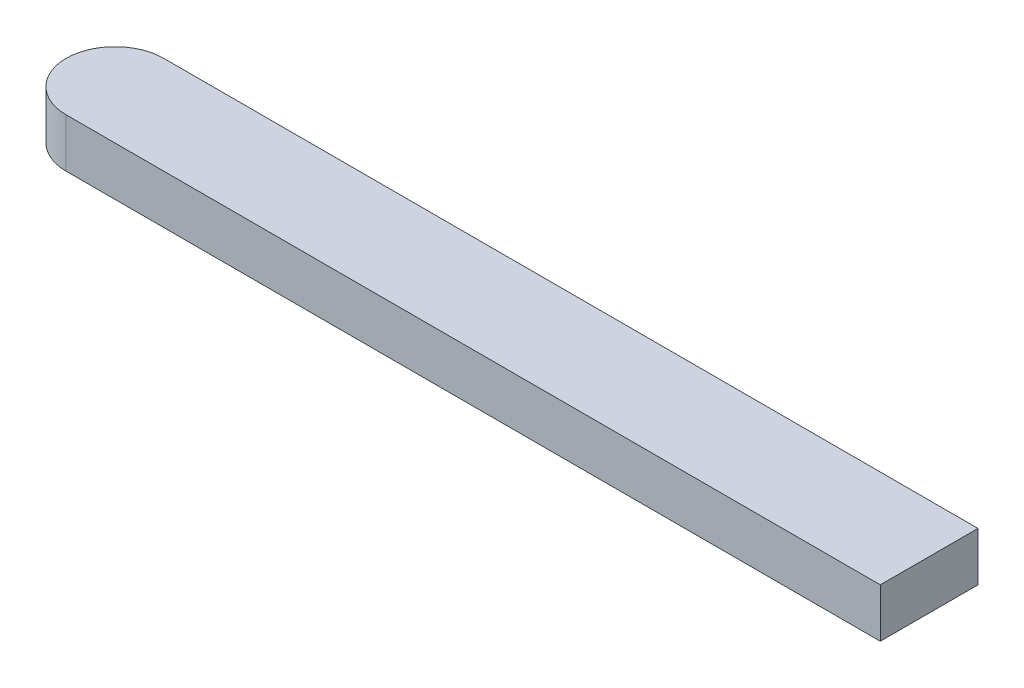
ISO-10303-21;
HEADER;
FILE_DESCRIPTION(('STEP AP214'),'2;1');
FILE_NAME('part.step','',(''),(''),'','','');
FILE_SCHEMA(('AUTOMOTIVE_DESIGN { 1 0 10303 214 1 1 1 1 }'));
ENDSEC;
DATA;
#1=APPLICATION_CONTEXT('core data for automotive mechanical design processes');
#2=APPLICATION_PROTOCOL_DEFINITION('international standard','automotive_design',2000,#1);
#3=PRODUCT_CONTEXT('',#1,'mechanical');
#4=PRODUCT('Part','Part','',(#3));
#5=PRODUCT_RELATED_PRODUCT_CATEGORY('part','',(#4));
#6=PRODUCT_DEFINITION_FORMATION('','',#4);
#7=PRODUCT_DEFINITION_CONTEXT('part definition',#1,'design');
#8=PRODUCT_DEFINITION('design','',#6,#7);
#9=PRODUCT_DEFINITION_SHAPE('','',#8);
#10=(LENGTH_UNIT() NAMED_UNIT(*) SI_UNIT(.MILLI.,.METRE.));
#11=(NAMED_UNIT(*) PLANE_ANGLE_UNIT() SI_UNIT($,.RADIAN.));
#12=(NAMED_UNIT(*) SI_UNIT($,.STERADIAN.) SOLID_ANGLE_UNIT());
#13=UNCERTAINTY_MEASURE_WITH_UNIT(LENGTH_MEASURE(1.E-05),#10,'distance_accuracy_value','');
#14=(GEOMETRIC_REPRESENTATION_CONTEXT(3) GLOBAL_UNCERTAINTY_ASSIGNED_CONTEXT((#13)) GLOBAL_UNIT_ASSIGNED_CONTEXT((#10,
#11,#12)) REPRESENTATION_CONTEXT('',''));
#15=CARTESIAN_POINT('',(0.,0.,0.));
#16=DIRECTION('',(0.,0.,1.));
#17=DIRECTION('',(1.,0.,0.));
#18=AXIS2_PLACEMENT_3D('',#15,#16,#17);
#19=CARTESIAN_POINT('',(0.,3.,0.));
#20=DIRECTION('',(0.,-1.,0.));
#21=DIRECTION('',(0.,0.,-1.));
#22=AXIS2_PLACEMENT_3D('',#19,#20,#21);
#23=CYLINDRICAL_SURFACE('',#22,3.);
#24=CARTESIAN_POINT('',(0.,0.,0.));
#25=DIRECTION('',(0.,1.,0.));
#26=DIRECTION('',(0.,0.,1.));
#27=AXIS2_PLACEMENT_3D('',#24,#25,#26);
#28=CIRCLE('',#27,3.);
#29=CARTESIAN_POINT('',(0.,0.,-3.));
#30=VERTEX_POINT('',#29);
#31=CARTESIAN_POINT('',(0.,0.,3.));
#32=VERTEX_POINT('',#31);
#33=EDGE_CURVE('E112',#30,#32,#28,.T.);
#34=ORIENTED_EDGE('',*,*,#33,.T.);
#35=DIRECTION('',(0.,-1.,0.));
#36=VECTOR('',#35,1.);
#37=CARTESIAN_POINT('',(0.,3.,3.));
#38=LINE('',#37,#36);
#39=CARTESIAN_POINT('',(0.,3.,3.));
#40=VERTEX_POINT('',#39);
#41=EDGE_CURVE('E64',#40,#32,#38,.T.);
#42=ORIENTED_EDGE('',*,*,#41,.F.);
#43=CARTESIAN_POINT('',(0.,3.,0.));
#44=DIRECTION('',(0.,1.,0.));
#45=DIRECTION('',(0.,0.,1.));
#46=AXIS2_PLACEMENT_3D('',#43,#44,#45);
#47=CIRCLE('',#46,3.);
#48=CARTESIAN_POINT('',(0.,3.,-3.));
#49=VERTEX_POINT('',#48);
#50=EDGE_CURVE('E123',#49,#40,#47,.T.);
#51=ORIENTED_EDGE('',*,*,#50,.F.);
#52=DIRECTION('',(0.,-1.,0.));
#53=VECTOR('',#52,1.);
#54=CARTESIAN_POINT('',(0.,3.,-3.));
#55=LINE('',#54,#53);
#56=EDGE_CURVE('E12',#49,#30,#55,.T.);
#57=ORIENTED_EDGE('',*,*,#56,.T.);
#58=EDGE_LOOP('',(#34,#42,#51,#57));
#59=FACE_BOUND('',#58,.T.);
#60=ADVANCED_FACE('F54',(#59),#23,.T.);
#61=CARTESIAN_POINT('',(0.,3.,0.));
#62=DIRECTION('',(0.,1.,0.));
#63=DIRECTION('',(0.,0.,1.));
#64=AXIS2_PLACEMENT_3D('',#61,#62,#63);
#65=PLANE('',#64);
#66=ORIENTED_EDGE('',*,*,#50,.T.);
#67=DIRECTION('',(1.,0.,0.));
#68=VECTOR('',#67,1.);
#69=CARTESIAN_POINT('',(0.,3.,3.));
#70=LINE('',#69,#68);
#71=CARTESIAN_POINT('',(50.,3.,3.));
#72=VERTEX_POINT('',#71);
#73=EDGE_CURVE('E118',#40,#72,#70,.T.);
#74=ORIENTED_EDGE('',*,*,#73,.T.);
#75=DIRECTION('',(0.,0.,-1.));
#76=VECTOR('',#75,1.);
#77=CARTESIAN_POINT('',(50.,3.,3.));
#78=LINE('',#77,#76);
#79=CARTESIAN_POINT('',(50.,3.,-3.));
#80=VERTEX_POINT('',#79);
#81=EDGE_CURVE('E111',#72,#80,#78,.T.);
#82=ORIENTED_EDGE('',*,*,#81,.T.);
#83=DIRECTION('',(1.,0.,0.));
#84=VECTOR('',#83,1.);
#85=CARTESIAN_POINT('',(0.,3.,-3.));
#86=LINE('',#85,#84);
#87=EDGE_CURVE('E105',#49,#80,#86,.T.);
#88=ORIENTED_EDGE('',*,*,#87,.F.);
#89=EDGE_LOOP('',(#66,#74,#82,#88));
#90=FACE_BOUND('',#89,.T.);
#91=ADVANCED_FACE('F128',(#90),#65,.T.);
#92=CARTESIAN_POINT('',(0.,0.,0.));
#93=DIRECTION('',(0.,1.,0.));
#94=DIRECTION('',(0.,0.,1.));
#95=AXIS2_PLACEMENT_3D('',#92,#93,#94);
#96=PLANE('',#95);
#97=ORIENTED_EDGE('',*,*,#33,.F.);
#98=DIRECTION('',(1.,0.,0.));
#99=VECTOR('',#98,1.);
#100=CARTESIAN_POINT('',(0.,0.,-3.));
#101=LINE('',#100,#99);
#102=CARTESIAN_POINT('',(50.,0.,-3.));
#103=VERTEX_POINT('',#102);
#104=EDGE_CURVE('E114',#30,#103,#101,.T.);
#105=ORIENTED_EDGE('',*,*,#104,.T.);
#106=DIRECTION('',(0.,0.,-1.));
#107=VECTOR('',#106,1.);
#108=CARTESIAN_POINT('',(50.,0.,3.));
#109=LINE('',#108,#107);
#110=CARTESIAN_POINT('',(50.,0.,3.));
#111=VERTEX_POINT('',#110);
#112=EDGE_CURVE('E106',#111,#103,#109,.T.);
#113=ORIENTED_EDGE('',*,*,#112,.F.);
#114=DIRECTION('',(1.,0.,0.));
#115=VECTOR('',#114,1.);
#116=CARTESIAN_POINT('',(0.,0.,3.));
#117=LINE('',#116,#115);
#118=EDGE_CURVE('E97',#32,#111,#117,.T.);
#119=ORIENTED_EDGE('',*,*,#118,.F.);
#120=EDGE_LOOP('',(#97,#105,#113,#119));
#121=FACE_BOUND('',#120,.T.);
#122=ADVANCED_FACE('F113',(#121),#96,.F.);
#123=CARTESIAN_POINT('',(0.,3.,3.));
#124=DIRECTION('',(0.,0.,-1.));
#125=DIRECTION('',(-1.,0.,0.));
#126=AXIS2_PLACEMENT_3D('',#123,#124,#125);
#127=PLANE('',#126);
#128=ORIENTED_EDGE('',*,*,#118,.T.);
#129=DIRECTION('',(0.,-1.,0.));
#130=VECTOR('',#129,1.);
#131=CARTESIAN_POINT('',(50.,3.,3.));
#132=LINE('',#131,#130);
#133=EDGE_CURVE('E100',#72,#111,#132,.T.);
#134=ORIENTED_EDGE('',*,*,#133,.F.);
#135=ORIENTED_EDGE('',*,*,#73,.F.);
#136=ORIENTED_EDGE('',*,*,#41,.T.);
#137=EDGE_LOOP('',(#128,#134,#135,#136));
#138=FACE_BOUND('',#137,.T.);
#139=ADVANCED_FACE('F99',(#138),#127,.F.);
#140=CARTESIAN_POINT('',(50.,3.,3.));
#141=DIRECTION('',(-1.,0.,0.));
#142=DIRECTION('',(0.,0.,1.));
#143=AXIS2_PLACEMENT_3D('',#140,#141,#142);
#144=PLANE('',#143);
#145=ORIENTED_EDGE('',*,*,#112,.T.);
#146=DIRECTION('',(0.,-1.,0.));
#147=VECTOR('',#146,1.);
#148=CARTESIAN_POINT('',(50.,3.,-3.));
#149=LINE('',#148,#147);
#150=EDGE_CURVE('E58',#80,#103,#149,.T.);
#151=ORIENTED_EDGE('',*,*,#150,.F.);
#152=ORIENTED_EDGE('',*,*,#81,.F.);
#153=ORIENTED_EDGE('',*,*,#133,.T.);
#154=EDGE_LOOP('',(#145,#151,#152,#153));
#155=FACE_BOUND('',#154,.T.);
#156=ADVANCED_FACE('F109',(#155),#144,.F.);
#157=CARTESIAN_POINT('',(0.,3.,-3.));
#158=DIRECTION('',(0.,0.,-1.));
#159=DIRECTION('',(-1.,0.,0.));
#160=AXIS2_PLACEMENT_3D('',#157,#158,#159);
#161=PLANE('',#160);
#162=ORIENTED_EDGE('',*,*,#104,.F.);
#163=ORIENTED_EDGE('',*,*,#56,.F.);
#164=ORIENTED_EDGE('',*,*,#87,.T.);
#165=ORIENTED_EDGE('',*,*,#150,.T.);
#166=EDGE_LOOP('',(#162,#163,#164,#165));
#167=FACE_BOUND('',#166,.T.);
#168=ADVANCED_FACE('F56',(#167),#161,.T.);
#169=CLOSED_SHELL('',(#60,#91,#122,#139,#156,#168));
#170=MANIFOLD_SOLID_BREP('B2',#169);
#171=ADVANCED_BREP_SHAPE_REPRESENTATION('',(#18,#170),#14);
#172=SHAPE_DEFINITION_REPRESENTATION(#9,#171);
ENDSEC;
END-ISO-10303-21;
